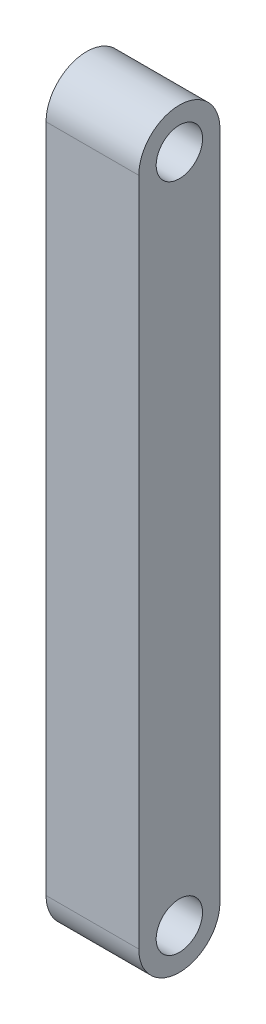
ISO-10303-21;
HEADER;
FILE_DESCRIPTION(('STEP AP214'),'2;1');
FILE_NAME('part.step','',(''),(''),'','','');
FILE_SCHEMA(('AUTOMOTIVE_DESIGN { 1 0 10303 214 1 1 1 1 }'));
ENDSEC;
DATA;
#1=APPLICATION_CONTEXT('core data for automotive mechanical design processes');
#2=APPLICATION_PROTOCOL_DEFINITION('international standard','automotive_design',2000,#1);
#3=PRODUCT_CONTEXT('',#1,'mechanical');
#4=PRODUCT('Part','Part','',(#3));
#5=PRODUCT_RELATED_PRODUCT_CATEGORY('part','',(#4));
#6=PRODUCT_DEFINITION_FORMATION('','',#4);
#7=PRODUCT_DEFINITION_CONTEXT('part definition',#1,'design');
#8=PRODUCT_DEFINITION('design','',#6,#7);
#9=PRODUCT_DEFINITION_SHAPE('','',#8);
#10=(LENGTH_UNIT() NAMED_UNIT(*) SI_UNIT(.MILLI.,.METRE.));
#11=(NAMED_UNIT(*) PLANE_ANGLE_UNIT() SI_UNIT($,.RADIAN.));
#12=(NAMED_UNIT(*) SI_UNIT($,.STERADIAN.) SOLID_ANGLE_UNIT());
#13=UNCERTAINTY_MEASURE_WITH_UNIT(LENGTH_MEASURE(1.E-05),#10,'distance_accuracy_value','');
#14=(GEOMETRIC_REPRESENTATION_CONTEXT(3) GLOBAL_UNCERTAINTY_ASSIGNED_CONTEXT((#13)) GLOBAL_UNIT_ASSIGNED_CONTEXT((#10,
#11,#12)) REPRESENTATION_CONTEXT('',''));
#15=CARTESIAN_POINT('',(0.,0.,0.));
#16=DIRECTION('',(0.,0.,1.));
#17=DIRECTION('',(1.,0.,0.));
#18=AXIS2_PLACEMENT_3D('',#15,#16,#17);
#19=CARTESIAN_POINT('',(8.,0.,-3.5));
#20=DIRECTION('',(0.,0.,-1.));
#21=DIRECTION('',(0.,1.,0.));
#22=AXIS2_PLACEMENT_3D('',#19,#20,#21);
#23=PLANE('',#22);
#24=DIRECTION('',(0.,-1.,0.));
#25=VECTOR('',#24,1.);
#26=CARTESIAN_POINT('',(0.,0.,-3.5));
#27=LINE('',#26,#25);
#28=CARTESIAN_POINT('',(0.,0.,-3.5));
#29=VERTEX_POINT('',#28);
#30=CARTESIAN_POINT('',(0.,-57.8,-3.5));
#31=VERTEX_POINT('',#30);
#32=EDGE_CURVE('E121',#29,#31,#27,.T.);
#33=ORIENTED_EDGE('',*,*,#32,.F.);
#34=DIRECTION('',(-1.,0.,0.));
#35=VECTOR('',#34,1.);
#36=CARTESIAN_POINT('',(8.,0.,-3.5));
#37=LINE('',#36,#35);
#38=CARTESIAN_POINT('',(8.,0.,-3.5));
#39=VERTEX_POINT('',#38);
#40=EDGE_CURVE('E11',#39,#29,#37,.T.);
#41=ORIENTED_EDGE('',*,*,#40,.F.);
#42=DIRECTION('',(0.,-1.,0.));
#43=VECTOR('',#42,1.);
#44=CARTESIAN_POINT('',(8.,0.,-3.5));
#45=LINE('',#44,#43);
#46=CARTESIAN_POINT('',(8.,-57.8,-3.5));
#47=VERTEX_POINT('',#46);
#48=EDGE_CURVE('E97',#39,#47,#45,.T.);
#49=ORIENTED_EDGE('',*,*,#48,.T.);
#50=DIRECTION('',(-1.,0.,0.));
#51=VECTOR('',#50,1.);
#52=CARTESIAN_POINT('',(8.,-57.8,-3.5));
#53=LINE('',#52,#51);
#54=EDGE_CURVE('E85',#47,#31,#53,.T.);
#55=ORIENTED_EDGE('',*,*,#54,.T.);
#56=EDGE_LOOP('',(#33,#41,#49,#55));
#57=FACE_BOUND('',#56,.T.);
#58=ADVANCED_FACE('F45',(#57),#23,.T.);
#59=CARTESIAN_POINT('',(8.,0.,0.));
#60=DIRECTION('',(-1.,0.,0.));
#61=DIRECTION('',(0.,0.,1.));
#62=AXIS2_PLACEMENT_3D('',#59,#60,#61);
#63=CYLINDRICAL_SURFACE('',#62,3.5);
#64=CARTESIAN_POINT('',(0.,0.,0.));
#65=DIRECTION('',(1.,0.,0.));
#66=DIRECTION('',(0.,0.,-1.));
#67=AXIS2_PLACEMENT_3D('',#64,#65,#66);
#68=CIRCLE('',#67,3.5);
#69=CARTESIAN_POINT('',(0.,0.,3.5));
#70=VERTEX_POINT('',#69);
#71=EDGE_CURVE('E103',#29,#70,#68,.T.);
#72=ORIENTED_EDGE('',*,*,#71,.T.);
#73=DIRECTION('',(-1.,0.,0.));
#74=VECTOR('',#73,1.);
#75=CARTESIAN_POINT('',(8.,0.,3.5));
#76=LINE('',#75,#74);
#77=CARTESIAN_POINT('',(8.,0.,3.5));
#78=VERTEX_POINT('',#77);
#79=EDGE_CURVE('E54',#78,#70,#76,.T.);
#80=ORIENTED_EDGE('',*,*,#79,.F.);
#81=CARTESIAN_POINT('',(8.,0.,0.));
#82=DIRECTION('',(1.,0.,0.));
#83=DIRECTION('',(0.,0.,-1.));
#84=AXIS2_PLACEMENT_3D('',#81,#82,#83);
#85=CIRCLE('',#84,3.5);
#86=EDGE_CURVE('E91',#39,#78,#85,.T.);
#87=ORIENTED_EDGE('',*,*,#86,.F.);
#88=ORIENTED_EDGE('',*,*,#40,.T.);
#89=EDGE_LOOP('',(#72,#80,#87,#88));
#90=FACE_BOUND('',#89,.T.);
#91=ADVANCED_FACE('F101',(#90),#63,.T.);
#92=CARTESIAN_POINT('',(8.,0.,3.5));
#93=DIRECTION('',(0.,0.,-1.));
#94=DIRECTION('',(0.,1.,0.));
#95=AXIS2_PLACEMENT_3D('',#92,#93,#94);
#96=PLANE('',#95);
#97=DIRECTION('',(0.,-1.,0.));
#98=VECTOR('',#97,1.);
#99=CARTESIAN_POINT('',(0.,0.,3.5));
#100=LINE('',#99,#98);
#101=CARTESIAN_POINT('',(0.,-57.8,3.5));
#102=VERTEX_POINT('',#101);
#103=EDGE_CURVE('E78',#70,#102,#100,.T.);
#104=ORIENTED_EDGE('',*,*,#103,.T.);
#105=DIRECTION('',(-1.,0.,0.));
#106=VECTOR('',#105,1.);
#107=CARTESIAN_POINT('',(8.,-57.8,3.5));
#108=LINE('',#107,#106);
#109=CARTESIAN_POINT('',(8.,-57.8,3.5));
#110=VERTEX_POINT('',#109);
#111=EDGE_CURVE('E105',#110,#102,#108,.T.);
#112=ORIENTED_EDGE('',*,*,#111,.F.);
#113=DIRECTION('',(0.,-1.,0.));
#114=VECTOR('',#113,1.);
#115=CARTESIAN_POINT('',(8.,0.,3.5));
#116=LINE('',#115,#114);
#117=EDGE_CURVE('E96',#78,#110,#116,.T.);
#118=ORIENTED_EDGE('',*,*,#117,.F.);
#119=ORIENTED_EDGE('',*,*,#79,.T.);
#120=EDGE_LOOP('',(#104,#112,#118,#119));
#121=FACE_BOUND('',#120,.T.);
#122=ADVANCED_FACE('F106',(#121),#96,.F.);
#123=CARTESIAN_POINT('',(8.,-57.8,0.));
#124=DIRECTION('',(-1.,0.,0.));
#125=DIRECTION('',(0.,0.,1.));
#126=AXIS2_PLACEMENT_3D('',#123,#124,#125);
#127=CYLINDRICAL_SURFACE('',#126,2.);
#128=CARTESIAN_POINT('',(8.,-57.8,0.));
#129=DIRECTION('',(1.,0.,0.));
#130=DIRECTION('',(0.,0.,-1.));
#131=AXIS2_PLACEMENT_3D('',#128,#129,#130);
#132=CIRCLE('',#131,2.);
#133=CARTESIAN_POINT('',(8.,-57.8,-2.00000000000001));
#134=VERTEX_POINT('',#133);
#135=EDGE_CURVE('E110',#134,#134,#132,.T.);
#136=ORIENTED_EDGE('',*,*,#135,.T.);
#137=EDGE_LOOP('',(#136));
#138=FACE_BOUND('',#137,.T.);
#139=CARTESIAN_POINT('',(0.,-57.8,0.));
#140=DIRECTION('',(1.,0.,0.));
#141=DIRECTION('',(0.,0.,-1.));
#142=AXIS2_PLACEMENT_3D('',#139,#140,#141);
#143=CIRCLE('',#142,2.);
#144=CARTESIAN_POINT('',(0.,-57.8,-2.00000000000001));
#145=VERTEX_POINT('',#144);
#146=EDGE_CURVE('E132',#145,#145,#143,.T.);
#147=ORIENTED_EDGE('',*,*,#146,.F.);
#148=EDGE_LOOP('',(#147));
#149=FACE_BOUND('',#148,.T.);
#150=ADVANCED_FACE('F156',(#138,#149),#127,.F.);
#151=CARTESIAN_POINT('',(8.,-57.8,0.));
#152=DIRECTION('',(-1.,0.,0.));
#153=DIRECTION('',(0.,0.,1.));
#154=AXIS2_PLACEMENT_3D('',#151,#152,#153);
#155=CYLINDRICAL_SURFACE('',#154,3.5);
#156=CARTESIAN_POINT('',(0.,-57.8,0.));
#157=DIRECTION('',(1.,0.,0.));
#158=DIRECTION('',(0.,0.,-1.));
#159=AXIS2_PLACEMENT_3D('',#156,#157,#158);
#160=CIRCLE('',#159,3.5);
#161=EDGE_CURVE('E129',#102,#31,#160,.T.);
#162=ORIENTED_EDGE('',*,*,#161,.T.);
#163=ORIENTED_EDGE('',*,*,#54,.F.);
#164=CARTESIAN_POINT('',(8.,-57.8,0.));
#165=DIRECTION('',(1.,0.,0.));
#166=DIRECTION('',(0.,0.,-1.));
#167=AXIS2_PLACEMENT_3D('',#164,#165,#166);
#168=CIRCLE('',#167,3.5);
#169=EDGE_CURVE('E62',#110,#47,#168,.T.);
#170=ORIENTED_EDGE('',*,*,#169,.F.);
#171=ORIENTED_EDGE('',*,*,#111,.T.);
#172=EDGE_LOOP('',(#162,#163,#170,#171));
#173=FACE_BOUND('',#172,.T.);
#174=ADVANCED_FACE('F145',(#173),#155,.T.);
#175=CARTESIAN_POINT('',(8.,0.,0.));
#176=DIRECTION('',(-1.,0.,0.));
#177=DIRECTION('',(0.,0.,1.));
#178=AXIS2_PLACEMENT_3D('',#175,#176,#177);
#179=CYLINDRICAL_SURFACE('',#178,2.);
#180=CARTESIAN_POINT('',(8.,0.,0.));
#181=DIRECTION('',(1.,0.,0.));
#182=DIRECTION('',(0.,0.,-1.));
#183=AXIS2_PLACEMENT_3D('',#180,#181,#182);
#184=CIRCLE('',#183,2.);
#185=CARTESIAN_POINT('',(8.,0.,-2.));
#186=VERTEX_POINT('',#185);
#187=EDGE_CURVE('E117',#186,#186,#184,.T.);
#188=ORIENTED_EDGE('',*,*,#187,.T.);
#189=EDGE_LOOP('',(#188));
#190=FACE_BOUND('',#189,.T.);
#191=CARTESIAN_POINT('',(0.,0.,0.));
#192=DIRECTION('',(1.,0.,0.));
#193=DIRECTION('',(0.,0.,-1.));
#194=AXIS2_PLACEMENT_3D('',#191,#192,#193);
#195=CIRCLE('',#194,2.);
#196=CARTESIAN_POINT('',(0.,0.,-2.));
#197=VERTEX_POINT('',#196);
#198=EDGE_CURVE('E136',#197,#197,#195,.T.);
#199=ORIENTED_EDGE('',*,*,#198,.F.);
#200=EDGE_LOOP('',(#199));
#201=FACE_BOUND('',#200,.T.);
#202=ADVANCED_FACE('F161',(#190,#201),#179,.F.);
#203=CARTESIAN_POINT('',(8.,0.,0.));
#204=DIRECTION('',(1.,0.,0.));
#205=DIRECTION('',(0.,0.,-1.));
#206=AXIS2_PLACEMENT_3D('',#203,#204,#205);
#207=PLANE('',#206);
#208=ORIENTED_EDGE('',*,*,#48,.F.);
#209=ORIENTED_EDGE('',*,*,#86,.T.);
#210=ORIENTED_EDGE('',*,*,#117,.T.);
#211=ORIENTED_EDGE('',*,*,#169,.T.);
#212=EDGE_LOOP('',(#208,#209,#210,#211));
#213=FACE_BOUND('',#212,.T.);
#214=ORIENTED_EDGE('',*,*,#135,.F.);
#215=EDGE_LOOP('',(#214));
#216=FACE_BOUND('',#215,.T.);
#217=ORIENTED_EDGE('',*,*,#187,.F.);
#218=EDGE_LOOP('',(#217));
#219=FACE_BOUND('',#218,.T.);
#220=ADVANCED_FACE('F93',(#213,#216,#219),#207,.T.);
#221=CARTESIAN_POINT('',(0.,0.,0.));
#222=DIRECTION('',(1.,0.,0.));
#223=DIRECTION('',(0.,0.,-1.));
#224=AXIS2_PLACEMENT_3D('',#221,#222,#223);
#225=PLANE('',#224);
#226=ORIENTED_EDGE('',*,*,#32,.T.);
#227=ORIENTED_EDGE('',*,*,#161,.F.);
#228=ORIENTED_EDGE('',*,*,#103,.F.);
#229=ORIENTED_EDGE('',*,*,#71,.F.);
#230=EDGE_LOOP('',(#226,#227,#228,#229));
#231=FACE_BOUND('',#230,.T.);
#232=ORIENTED_EDGE('',*,*,#146,.T.);
#233=EDGE_LOOP('',(#232));
#234=FACE_BOUND('',#233,.T.);
#235=ORIENTED_EDGE('',*,*,#198,.T.);
#236=EDGE_LOOP('',(#235));
#237=FACE_BOUND('',#236,.T.);
#238=ADVANCED_FACE('F147',(#231,#234,#237),#225,.F.);
#239=CLOSED_SHELL('',(#58,#91,#122,#150,#174,#202,#220,#238));
#240=MANIFOLD_SOLID_BREP('B2',#239);
#241=ADVANCED_BREP_SHAPE_REPRESENTATION('',(#18,#240),#14);
#242=SHAPE_DEFINITION_REPRESENTATION(#9,#241);
ENDSEC;
END-ISO-10303-21;
